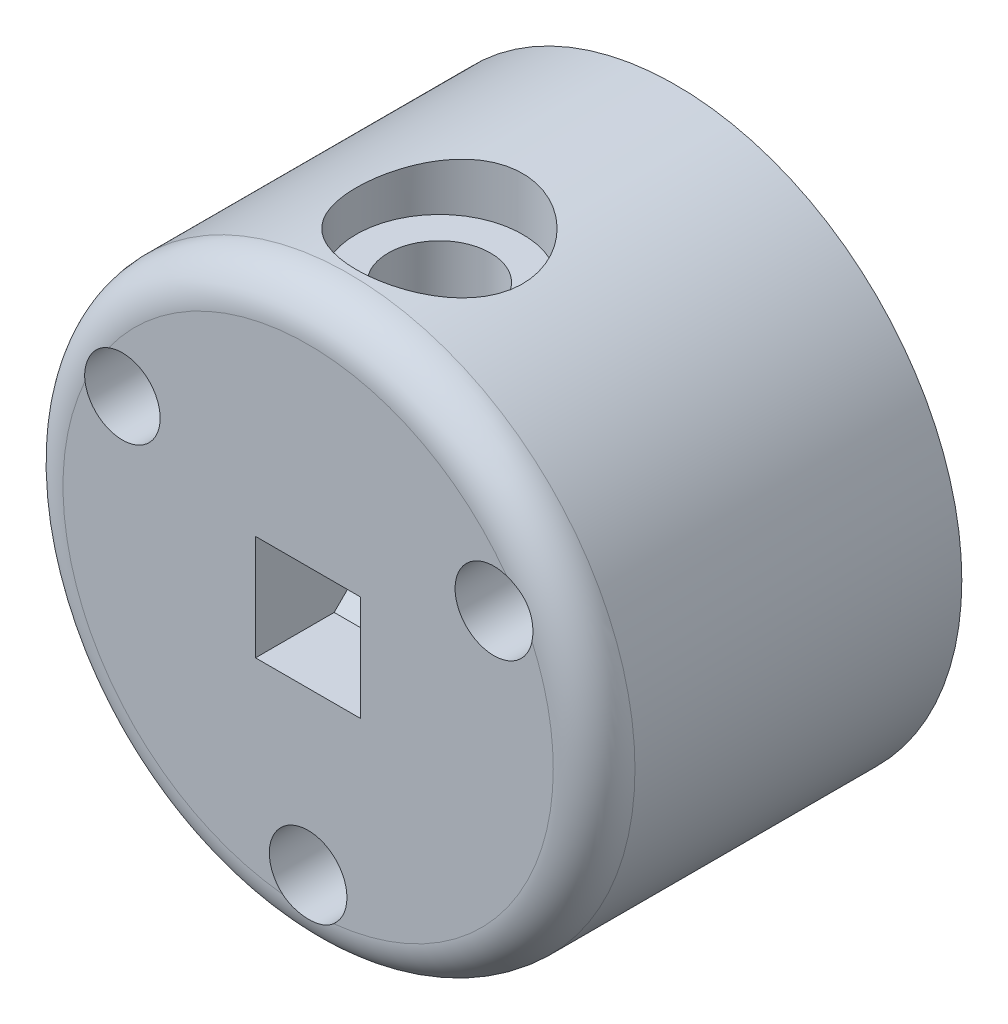
ISO-10303-21;
HEADER;
FILE_DESCRIPTION(('STEP AP214'),'2;1');
FILE_NAME('part.step','',(''),(''),'','','');
FILE_SCHEMA(('AUTOMOTIVE_DESIGN { 1 0 10303 214 1 1 1 1 }'));
ENDSEC;
DATA;
#1=APPLICATION_CONTEXT('core data for automotive mechanical design processes');
#2=APPLICATION_PROTOCOL_DEFINITION('international standard','automotive_design',2000,#1);
#3=PRODUCT_CONTEXT('',#1,'mechanical');
#4=PRODUCT('Part','Part','',(#3));
#5=PRODUCT_RELATED_PRODUCT_CATEGORY('part','',(#4));
#6=PRODUCT_DEFINITION_FORMATION('','',#4);
#7=PRODUCT_DEFINITION_CONTEXT('part definition',#1,'design');
#8=PRODUCT_DEFINITION('design','',#6,#7);
#9=PRODUCT_DEFINITION_SHAPE('','',#8);
#10=(LENGTH_UNIT() NAMED_UNIT(*) SI_UNIT(.MILLI.,.METRE.));
#11=(NAMED_UNIT(*) PLANE_ANGLE_UNIT() SI_UNIT($,.RADIAN.));
#12=(NAMED_UNIT(*) SI_UNIT($,.STERADIAN.) SOLID_ANGLE_UNIT());
#13=UNCERTAINTY_MEASURE_WITH_UNIT(LENGTH_MEASURE(1.E-05),#10,'distance_accuracy_value','');
#14=(GEOMETRIC_REPRESENTATION_CONTEXT(3) GLOBAL_UNCERTAINTY_ASSIGNED_CONTEXT((#13)) GLOBAL_UNIT_ASSIGNED_CONTEXT((#10,
#11,#12)) REPRESENTATION_CONTEXT('',''));
#15=CARTESIAN_POINT('',(0.,0.,0.));
#16=DIRECTION('',(0.,0.,1.));
#17=DIRECTION('',(1.,0.,0.));
#18=AXIS2_PLACEMENT_3D('',#15,#16,#17);
#19=CARTESIAN_POINT('',(0.,20.575,11.575));
#20=DIRECTION('',(0.,-1.,0.));
#21=DIRECTION('',(0.,0.,-1.));
#22=AXIS2_PLACEMENT_3D('',#19,#20,#21);
#23=CYLINDRICAL_SURFACE('',#22,2.5);
#24=CARTESIAN_POINT('',(0.,2.575,11.575));
#25=DIRECTION('',(0.,-1.,0.));
#26=DIRECTION('',(0.,0.,-1.));
#27=AXIS2_PLACEMENT_3D('',#24,#25,#26);
#28=CIRCLE('',#27,2.5);
#29=CARTESIAN_POINT('',(0.,2.575,9.07500000000001));
#30=VERTEX_POINT('',#29);
#31=EDGE_CURVE('E216',#30,#30,#28,.T.);
#32=ORIENTED_EDGE('',*,*,#31,.T.);
#33=EDGE_LOOP('',(#32));
#34=FACE_BOUND('',#33,.T.);
#35=CARTESIAN_POINT('',(0.,11.4164078649987,11.575));
#36=DIRECTION('',(0.,1.,0.));
#37=DIRECTION('',(0.,0.,1.));
#38=AXIS2_PLACEMENT_3D('',#35,#36,#37);
#39=CIRCLE('',#38,2.5);
#40=CARTESIAN_POINT('',(0.,11.4164078649987,14.075));
#41=VERTEX_POINT('',#40);
#42=EDGE_CURVE('E210',#41,#41,#39,.F.);
#43=ORIENTED_EDGE('',*,*,#42,.F.);
#44=EDGE_LOOP('',(#43));
#45=FACE_BOUND('',#44,.T.);
#46=ADVANCED_FACE('F35',(#34,#45),#23,.F.);
#47=CARTESIAN_POINT('',(0.,0.,22.));
#48=DIRECTION('',(0.,0.,-1.));
#49=DIRECTION('',(-1.,0.,0.));
#50=AXIS2_PLACEMENT_3D('',#47,#48,#49);
#51=CYLINDRICAL_SURFACE('',#50,14.);
#52=CARTESIAN_POINT('',(0.,14.,15.65));
#53=CARTESIAN_POINT('',(-0.223854655469927,13.9999975932515,15.6499964915354));
#54=CARTESIAN_POINT('',(-0.447745073296723,13.9945792185035,15.6314928943772));
#55=CARTESIAN_POINT('',(-0.88902537024807,13.9734926641267,15.5581305299539));
#56=CARTESIAN_POINT('',(-1.1064129553758,13.9578209109947,15.5032590876956));
#57=CARTESIAN_POINT('',(-1.52825779417562,13.9179483166286,15.3591341932266));
#58=CARTESIAN_POINT('',(-1.73273298527214,13.8937596285321,15.2699297153308));
#59=CARTESIAN_POINT('',(-2.123823315558,13.8393789157117,15.0598664867856));
#60=CARTESIAN_POINT('',(-2.31043639201679,13.809186198874,14.9390040862626));
#61=CARTESIAN_POINT('',(-2.66557900733791,13.7451109529002,14.6655911784061));
#62=CARTESIAN_POINT('',(-2.8335541023685,13.7111561966808,14.512337444461));
#63=CARTESIAN_POINT('',(-3.14181891391625,13.6438235572355,14.1799921487467));
#64=CARTESIAN_POINT('',(-3.2821042959688,13.6104457650709,14.0008965493529));
#65=CARTESIAN_POINT('',(-3.53386472447389,13.5472893352413,13.6173344437628));
#66=CARTESIAN_POINT('',(-3.64467392770465,13.5176008496088,13.4124146646601));
#67=CARTESIAN_POINT('',(-3.83003668374098,13.4662591658294,12.9858466070145));
#68=CARTESIAN_POINT('',(-3.90459836890721,13.4446041655777,12.764202093675));
#69=CARTESIAN_POINT('',(-4.01337071562984,13.4125320588944,12.3166795849564));
#70=CARTESIAN_POINT('',(-4.04859898265162,13.4018321713561,12.0910697184409));
#71=CARTESIAN_POINT('',(-4.08088082327906,13.3920394800779,11.6369078728874));
#72=CARTESIAN_POINT('',(-4.07794304091861,13.3929440481035,11.4083565717543));
#73=CARTESIAN_POINT('',(-4.03477783019962,13.4060067450529,10.9629795759345));
#74=CARTESIAN_POINT('',(-3.99581279639697,13.4177838781798,10.7460185279017));
#75=CARTESIAN_POINT('',(-3.88373382483836,13.4506501131767,10.3218563446633));
#76=CARTESIAN_POINT('',(-3.81061669533787,13.4717400853846,10.1146561236658));
#77=CARTESIAN_POINT('',(-3.63135218679836,13.5211682308823,9.71275338401689));
#78=CARTESIAN_POINT('',(-3.52478626326112,13.549597391142,9.51824921934972));
#79=CARTESIAN_POINT('',(-3.28194032683873,13.6104555012872,9.1494552595611));
#80=CARTESIAN_POINT('',(-3.14565348005207,13.6428853703324,8.97517012766028));
#81=CARTESIAN_POINT('',(-2.84091306778801,13.7096474706407,8.64458623416677));
#82=CARTESIAN_POINT('',(-2.67140827378113,13.7440044498963,8.48925993486754));
#83=CARTESIAN_POINT('',(-2.30832990209667,13.809619770865,8.20901876769532));
#84=CARTESIAN_POINT('',(-2.11475498225879,13.8408779396124,8.08410559682092));
#85=CARTESIAN_POINT('',(-1.7073370687848,13.8970313755333,7.86769226459663));
#86=CARTESIAN_POINT('',(-1.49337962628358,13.9218874116628,7.77639670688054));
#87=CARTESIAN_POINT('',(-1.05225828766325,13.9621533224821,7.63136668935529));
#88=CARTESIAN_POINT('',(-0.825097867978545,13.9775656715334,7.57762239013919));
#89=CARTESIAN_POINT('',(-0.372294767959097,13.9968210314728,7.51081369486199));
#90=CARTESIAN_POINT('',(-0.146862361528772,14.0010390385308,7.49643022717675));
#91=CARTESIAN_POINT('',(0.303204317578375,13.9985244794481,7.50506946932812));
#92=CARTESIAN_POINT('',(0.527838686464654,13.9917932815482,7.528087505376));
#93=CARTESIAN_POINT('',(0.965029510881966,13.9683813245689,7.60980503052112));
#94=CARTESIAN_POINT('',(1.17774065064616,13.9519129091333,7.66774350228958));
#95=CARTESIAN_POINT('',(1.59038479495726,13.9109204272878,7.81675054432684));
#96=CARTESIAN_POINT('',(1.79031629546684,13.8863954147735,7.90782300572963));
#97=CARTESIAN_POINT('',(2.17665551673273,13.8311649861528,8.12279089347821));
#98=CARTESIAN_POINT('',(2.36266419738823,13.800334388829,8.24737046253601));
#99=CARTESIAN_POINT('',(2.71158950480605,13.7360406339625,8.52497719695255));
#100=CARTESIAN_POINT('',(2.8745006630614,13.7025768559016,8.67801107932035));
#101=CARTESIAN_POINT('',(3.17834731991831,13.6353649308793,9.01437149873764));
#102=CARTESIAN_POINT('',(3.31834602450779,13.601645877628,9.19855185838806));
#103=CARTESIAN_POINT('',(3.56550234215855,13.5389626578495,9.58852118079462));
#104=CARTESIAN_POINT('',(3.67266100456062,13.5099983394077,9.79430945282903));
#105=CARTESIAN_POINT('',(3.85032911026586,13.460441393492,10.2208665750983));
#106=CARTESIAN_POINT('',(3.92102505439581,13.4398062838623,10.441552528873));
#107=CARTESIAN_POINT('',(4.02406638172604,13.409318879457,10.8924017407376));
#108=CARTESIAN_POINT('',(4.05642393983087,13.3994631616074,11.1225619660987));
#109=CARTESIAN_POINT('',(4.08107610783079,13.3919737998199,11.576135347318));
#110=CARTESIAN_POINT('',(4.07489148192856,13.3938761896151,11.7994593093071));
#111=CARTESIAN_POINT('',(4.02623643259421,13.4085812819218,12.2417345600363));
#112=CARTESIAN_POINT('',(3.98376730710923,13.4213835945278,12.4606860049008));
#113=CARTESIAN_POINT('',(3.86470410379516,13.4561441582198,12.8856750763565));
#114=CARTESIAN_POINT('',(3.78849028647301,13.4780002129358,13.0918282034438));
#115=CARTESIAN_POINT('',(3.60439575153752,13.5283922905509,13.4885851880944));
#116=CARTESIAN_POINT('',(3.49650925582451,13.5569295321176,13.6791862003442));
#117=CARTESIAN_POINT('',(3.24776706346828,13.6186983847277,14.0465425395881));
#118=CARTESIAN_POINT('',(3.10590183133288,13.6520580395081,14.2225927880914));
#119=CARTESIAN_POINT('',(2.79507475204947,13.7190668065959,14.5488816954975));
#120=CARTESIAN_POINT('',(2.62610601395703,13.7527159904505,14.6991137700715));
#121=CARTESIAN_POINT('',(2.26037876871163,13.8175993540115,14.9735239509894));
#122=CARTESIAN_POINT('',(2.06299391180743,13.8487439786545,15.0968905368656));
#123=CARTESIAN_POINT('',(1.64937808494276,13.9040629840343,15.3085070548442));
#124=CARTESIAN_POINT('',(1.43315694248033,13.9282409714614,15.3967751667667));
#125=CARTESIAN_POINT('',(1.0154197309062,13.9645037904108,15.5267557281237));
#126=CARTESIAN_POINT('',(0.815355607669857,13.9777086039219,15.5728522953755));
#127=CARTESIAN_POINT('',(0.410203841367488,13.9954571812365,15.6344738144954));
#128=CARTESIAN_POINT('',(0.20511693366376,14.0000022052919,15.6500032147891));
#129=CARTESIAN_POINT('',(0.,14.,15.65));
#130=B_SPLINE_CURVE_WITH_KNOTS('',3,(#52,#53,#54,#55,#56,#57,#58,#59,#60,#61,#62,#63,#64,#65,
#66,#67,#68,#69,#70,#71,#72,#73,#74,#75,#76,#77,#78,#79,#80,#81,#82,#83,#84,#85,#86,#87,#88,#89,
#90,#91,#92,#93,#94,#95,#96,#97,#98,#99,#100,#101,#102,#103,#104,#105,#106,#107,#108,#109,#110,
#111,#112,#113,#114,#115,#116,#117,#118,#119,#120,#121,#122,#123,#124,#125,#126,#127,#128,#129),
.UNSPECIFIED.,.T.,.F.,(4,2,2,2,2,2,2,2,2,2,2,2,2,2,2,2,2,2,2,2,2,2,2,2,2,2,2,2,2,2,2,2,2,2,2,2,
2,2,4),(0.,0.670810870883039,1.34185565712039,2.01194675892948,2.68211515024255,
3.36868746986491,4.05536717837259,4.75644658538705,5.45736862811399,6.13970344446604,
6.82188372497978,7.48103090955527,8.14023970822678,8.80805016017638,9.4760143278037,
10.1701538911145,10.8643321773094,11.5626681501811,12.2608210721635,12.9352729330826,
13.6096405192325,14.2698177572771,14.9300725491492,15.6049931889712,16.2800733552935,
16.978132717206,17.6761697716393,18.3706001624563,19.0648099677823,19.7318064055585,
20.3987789849414,21.0584196740221,21.7181807773171,22.4007168210781,23.0834266724126,
23.7845405935671,24.4852908869394,25.1000411010829,25.7147018443004),.UNSPECIFIED.);
#131=CARTESIAN_POINT('',(0.,14.,15.65));
#132=VERTEX_POINT('',#131);
#133=EDGE_CURVE('E40',#132,#132,#130,.T.);
#134=ORIENTED_EDGE('',*,*,#133,.T.);
#135=EDGE_LOOP('',(#134));
#136=FACE_BOUND('',#135,.T.);
#137=CARTESIAN_POINT('',(0.,0.,16.));
#138=DIRECTION('',(0.,0.,1.));
#139=DIRECTION('',(1.,0.,0.));
#140=AXIS2_PLACEMENT_3D('',#137,#138,#139);
#141=CIRCLE('',#140,14.);
#142=CARTESIAN_POINT('',(14.,0.,16.));
#143=VERTEX_POINT('',#142);
#144=EDGE_CURVE('E11',#143,#143,#141,.F.);
#145=ORIENTED_EDGE('',*,*,#144,.T.);
#146=EDGE_LOOP('',(#145));
#147=FACE_BOUND('',#146,.T.);
#148=CARTESIAN_POINT('',(0.,0.,0.));
#149=DIRECTION('',(0.,0.,1.));
#150=DIRECTION('',(1.,0.,0.));
#151=AXIS2_PLACEMENT_3D('',#148,#149,#150);
#152=CIRCLE('',#151,14.);
#153=CARTESIAN_POINT('',(14.,0.,0.));
#154=VERTEX_POINT('',#153);
#155=EDGE_CURVE('E111',#154,#154,#152,.T.);
#156=ORIENTED_EDGE('',*,*,#155,.T.);
#157=EDGE_LOOP('',(#156));
#158=FACE_BOUND('',#157,.T.);
#159=ADVANCED_FACE('F192',(#136,#147,#158),#51,.T.);
#160=CARTESIAN_POINT('',(-9.0932667397366,5.25,3.));
#161=DIRECTION('',(0.,0.,1.));
#162=DIRECTION('',(1.,0.,0.));
#163=AXIS2_PLACEMENT_3D('',#160,#161,#162);
#164=CYLINDRICAL_SURFACE('',#163,1.85);
#165=CARTESIAN_POINT('',(-9.0932667397366,5.25,3.));
#166=DIRECTION('',(0.,0.,1.));
#167=DIRECTION('',(1.,0.,0.));
#168=AXIS2_PLACEMENT_3D('',#165,#166,#167);
#169=CIRCLE('',#168,1.85);
#170=CARTESIAN_POINT('',(-7.2432667397366,5.25,3.));
#171=VERTEX_POINT('',#170);
#172=EDGE_CURVE('E139',#171,#171,#169,.T.);
#173=ORIENTED_EDGE('',*,*,#172,.F.);
#174=EDGE_LOOP('',(#173));
#175=FACE_BOUND('',#174,.T.);
#176=CARTESIAN_POINT('',(-9.0932667397366,5.25,18.));
#177=DIRECTION('',(0.,0.,1.));
#178=DIRECTION('',(1.,0.,0.));
#179=AXIS2_PLACEMENT_3D('',#176,#177,#178);
#180=CIRCLE('',#179,1.85);
#181=CARTESIAN_POINT('',(-9.76583355470285,6.97341343832702,18.));
#182=VERTEX_POINT('',#181);
#183=CARTESIAN_POINT('',(-10.9220699660344,4.97075322833965,18.));
#184=VERTEX_POINT('',#183);
#185=EDGE_CURVE('E230',#182,#184,#180,.F.);
#186=ORIENTED_EDGE('',*,*,#185,.F.);
#187=CARTESIAN_POINT('',(-9.76583355470285,6.97341343832702,18.));
#188=CARTESIAN_POINT('',(-9.81419478291767,6.95454034418415,17.9999953490431));
#189=CARTESIAN_POINT('',(-9.86173150149319,6.93364206673434,17.9993962519027));
#190=CARTESIAN_POINT('',(-9.95486035288913,6.88794034133642,17.9973793504741));
#191=CARTESIAN_POINT('',(-10.0004528710693,6.863137671893,17.995961709247));
#192=CARTESIAN_POINT('',(-10.1338250744244,6.78312286784872,17.9910383027019));
#193=CARTESIAN_POINT('',(-10.2182811861827,6.72227191888798,17.9868608095263));
#194=CARTESIAN_POINT('',(-10.375802516048,6.58730134554035,17.9791132411159));
#195=CARTESIAN_POINT('',(-10.4488664669279,6.51318024699217,17.9755432334518));
#196=CARTESIAN_POINT('',(-10.5815472268755,6.3537471598713,17.9705749489343));
#197=CARTESIAN_POINT('',(-10.6411741387818,6.26844365580235,17.9691750357757));
#198=CARTESIAN_POINT('',(-10.7451549022834,6.08932608168787,17.9691003437342));
#199=CARTESIAN_POINT('',(-10.7895510519696,5.99553651060639,17.9704179452693));
#200=CARTESIAN_POINT('',(-10.8620855700994,5.80179158839658,17.9752480139006));
#201=CARTESIAN_POINT('',(-10.8902115162802,5.70183159043051,17.9787621538015));
#202=CARTESIAN_POINT('',(-10.9197792814844,5.54856828612012,17.9845559925943));
#203=CARTESIAN_POINT('',(-10.9275434115511,5.49639607068947,17.9865971467026));
#204=CARTESIAN_POINT('',(-10.9385945757635,5.39156097069196,17.9905524255186));
#205=CARTESIAN_POINT('',(-10.9418816583123,5.33889809143606,17.9924665515996));
#206=CARTESIAN_POINT('',(-10.9439441583613,5.23346352772024,17.9958392741598));
#207=CARTESIAN_POINT('',(-10.9427189279102,5.18069182872168,17.9972978051848));
#208=CARTESIAN_POINT('',(-10.9357677880781,5.07542028435191,17.9993750911791));
#209=CARTESIAN_POINT('',(-10.9300410336698,5.02292049188584,17.9999936884164));
#210=CARTESIAN_POINT('',(-10.9220699660344,4.97075322833965,18.));
#211=B_SPLINE_CURVE_WITH_KNOTS('',3,(#187,#188,#189,#190,#191,#192,#193,#194,#195,#196,#197,
#198,#199,#200,#201,#202,#203,#204,#205,#206,#207,#208,#209,#210),.UNSPECIFIED.,.F.,.F.,(4,2,2,
2,2,2,2,2,2,2,2,4),(0.,0.155631865288573,0.311232738036358,0.622174380070197,0.933150585608174,
1.24389219310237,1.55376370335756,1.86387148859661,2.02207196120744,2.18027072343681,
2.33849220330872,2.49674339165615),.UNSPECIFIED.);
#212=EDGE_CURVE('E175',#182,#184,#211,.T.);
#213=ORIENTED_EDGE('',*,*,#212,.T.);
#214=EDGE_LOOP('',(#186,#213));
#215=FACE_BOUND('',#214,.T.);
#216=ADVANCED_FACE('F186',(#175,#215),#164,.F.);
#217=CARTESIAN_POINT('',(9.0932667397366,5.25000000000001,3.));
#218=DIRECTION('',(0.,0.,1.));
#219=DIRECTION('',(1.,0.,0.));
#220=AXIS2_PLACEMENT_3D('',#217,#218,#219);
#221=CYLINDRICAL_SURFACE('',#220,1.9);
#222=CARTESIAN_POINT('',(9.0932667397366,5.25000000000001,3.));
#223=DIRECTION('',(0.,0.,1.));
#224=DIRECTION('',(1.,0.,0.));
#225=AXIS2_PLACEMENT_3D('',#222,#223,#224);
#226=CIRCLE('',#225,1.9);
#227=CARTESIAN_POINT('',(10.9932667397366,5.25000000000001,3.));
#228=VERTEX_POINT('',#227);
#229=EDGE_CURVE('E142',#228,#228,#226,.T.);
#230=ORIENTED_EDGE('',*,*,#229,.F.);
#231=EDGE_LOOP('',(#230));
#232=FACE_BOUND('',#231,.T.);
#233=CARTESIAN_POINT('',(9.0932667397366,5.25000000000001,18.));
#234=DIRECTION('',(0.,0.,1.));
#235=DIRECTION('',(1.,0.,0.));
#236=AXIS2_PLACEMENT_3D('',#233,#234,#235);
#237=CIRCLE('',#236,1.9);
#238=CARTESIAN_POINT('',(10.9587327660457,4.88939425311515,18.));
#239=VERTEX_POINT('',#238);
#240=CARTESIAN_POINT('',(9.71370601533822,7.04584384212296,18.));
#241=VERTEX_POINT('',#240);
#242=EDGE_CURVE('E227',#239,#241,#237,.F.);
#243=ORIENTED_EDGE('',*,*,#242,.F.);
#244=CARTESIAN_POINT('',(10.9587327660457,4.88939425311515,18.));
#245=CARTESIAN_POINT('',(10.9688443679225,4.9417018114777,17.9999954085785));
#246=CARTESIAN_POINT('',(10.9767478068304,4.99440138836569,17.9993008844636));
#247=CARTESIAN_POINT('',(10.9881037589419,5.10024390536341,17.9969359407984));
#248=CARTESIAN_POINT('',(10.9915574033111,5.15338672933835,17.9952657694208));
#249=CARTESIAN_POINT('',(10.995195111867,5.31289127525907,17.9894010995555));
#250=CARTESIAN_POINT('',(10.988678572368,5.41944685267198,17.984350638412));
#251=CARTESIAN_POINT('',(10.9579318219523,5.62993606889986,17.9746594335247));
#252=CARTESIAN_POINT('',(10.9337015613189,5.73386970035503,17.9700186909308));
#253=CARTESIAN_POINT('',(10.8681887836905,5.93625625505262,17.9630246018036));
#254=CARTESIAN_POINT('',(10.8269166566248,6.03471247628275,17.9606698644858));
#255=CARTESIAN_POINT('',(10.7285578866345,6.22319427031509,17.9591103385104));
#256=CARTESIAN_POINT('',(10.6714979013619,6.31323371490262,17.9599002699465));
#257=CARTESIAN_POINT('',(10.5431374702334,6.4825447878215,17.9643350480736));
#258=CARTESIAN_POINT('',(10.4718257907694,6.56180783853801,17.967982153538));
#259=CARTESIAN_POINT('',(10.3173956125077,6.70694922407907,17.9767297062392));
#260=CARTESIAN_POINT('',(10.2343304779817,6.77288495147714,17.9818236841418));
#261=CARTESIAN_POINT('',(10.0584606552291,6.88997432964337,17.9912118297136));
#262=CARTESIAN_POINT('',(9.96567595247153,6.94115753173,17.9955075900971));
#263=CARTESIAN_POINT('',(9.84388909142107,6.99566635812074,17.9985880502661));
#264=CARTESIAN_POINT('',(9.81814887000062,7.00651025991796,17.9991025086461));
#265=CARTESIAN_POINT('',(9.76624415098066,7.02704159476066,17.9998083011462));
#266=CARTESIAN_POINT('',(9.74008022273438,7.03673045364885,18.00000003757));
#267=CARTESIAN_POINT('',(9.71370601533822,7.04584384212296,18.));
#268=B_SPLINE_CURVE_WITH_KNOTS('',3,(#244,#245,#246,#247,#248,#249,#250,#251,#252,#253,#254,
#255,#256,#257,#258,#259,#260,#261,#262,#263,#264,#265,#266,#267),.UNSPECIFIED.,.F.,.F.,(4,2,2,
2,2,2,2,2,2,2,2,4),(0.,0.159713609557011,0.319386610901691,0.638377428682884,0.957369141771231,
1.27616666138858,1.59442914514376,1.9129434893468,2.23005550790127,2.54652782160906,
2.63031677426456,2.71400119843349),.UNSPECIFIED.);
#269=EDGE_CURVE('E48',#239,#241,#268,.T.);
#270=ORIENTED_EDGE('',*,*,#269,.T.);
#271=EDGE_LOOP('',(#243,#270));
#272=FACE_BOUND('',#271,.T.);
#273=ADVANCED_FACE('F191',(#232,#272),#221,.F.);
#274=CARTESIAN_POINT('',(0.,-10.5,3.));
#275=DIRECTION('',(0.,0.,1.));
#276=DIRECTION('',(1.,0.,0.));
#277=AXIS2_PLACEMENT_3D('',#274,#275,#276);
#278=CYLINDRICAL_SURFACE('',#277,1.9);
#279=CARTESIAN_POINT('',(0.,-10.5,3.));
#280=DIRECTION('',(0.,0.,1.));
#281=DIRECTION('',(1.,0.,0.));
#282=AXIS2_PLACEMENT_3D('',#279,#280,#281);
#283=CIRCLE('',#282,1.9);
#284=CARTESIAN_POINT('',(1.9,-10.5,3.));
#285=VERTEX_POINT('',#284);
#286=EDGE_CURVE('E135',#285,#285,#283,.T.);
#287=ORIENTED_EDGE('',*,*,#286,.F.);
#288=EDGE_LOOP('',(#287));
#289=FACE_BOUND('',#288,.T.);
#290=CARTESIAN_POINT('',(0.,-10.5,18.));
#291=DIRECTION('',(0.,0.,1.));
#292=DIRECTION('',(1.,0.,0.));
#293=AXIS2_PLACEMENT_3D('',#290,#291,#292);
#294=CIRCLE('',#293,1.9);
#295=CARTESIAN_POINT('',(-1.24502675070752,-11.9352380952381,18.));
#296=VERTEX_POINT('',#295);
#297=CARTESIAN_POINT('',(1.24502675070752,-11.9352380952381,18.));
#298=VERTEX_POINT('',#297);
#299=EDGE_CURVE('E120',#296,#298,#294,.F.);
#300=ORIENTED_EDGE('',*,*,#299,.F.);
#301=CARTESIAN_POINT('',(-1.24502675070752,-11.9352380952381,18.));
#302=CARTESIAN_POINT('',(-1.20478287729397,-11.9701487785176,17.9999954085785));
#303=CARTESIAN_POINT('',(-1.16309542439424,-12.0033431458331,17.9993008844636));
#304=CARTESIAN_POINT('',(-1.07711109192949,-12.0660989473447,17.9969359407984));
#305=CARTESIAN_POINT('',(-1.03281487852293,-12.0956613030915,17.9952657694208));
#306=CARTESIAN_POINT('',(-0.896498744014434,-12.1785639240728,17.9894010995555));
#307=CARTESIAN_POINT('',(-0.80096063731047,-12.2261982240284,17.984350638412));
#308=CARTESIAN_POINT('',(-0.603298253626596,-12.3048153651985,17.9746594335247));
#309=CARTESIAN_POINT('',(-0.501173958162126,-12.3357981596772,17.9700186909308));
#310=CARTESIAN_POINT('',(-0.293145671595394,-12.3802557073274,17.9630246018036));
#311=CARTESIAN_POINT('',(-0.187244019316645,-12.3937411074353,17.9606698644858));
#312=CARTESIAN_POINT('',(0.0251653874613588,-12.4028008109549,17.9591103385104));
#313=CARTESIAN_POINT('',(0.131671826453115,-12.398405136463,17.9599002699465));
#314=CARTESIAN_POINT('',(0.342479732307121,-12.3718972787245,17.9643350480736));
#315=CARTESIAN_POINT('',(0.446779387541044,-12.3497710780804,17.967982153538));
#316=CARTESIAN_POINT('',(0.649690603690957,-12.2886013133653,17.9767297062392));
#317=CARTESIAN_POINT('',(0.748325185897672,-12.2496326603961,17.9818236841418));
#318=CARTESIAN_POINT('',(0.937662473279261,-12.1558696152164,17.9912118297136));
#319=CARTESIAN_POINT('',(1.02838077791209,-12.101107306589,17.9955075900971));
#320=CARTESIAN_POINT('',(1.13648023682218,-12.0228912042675,17.9985880502661));
#321=CARTESIAN_POINT('',(1.15874144196494,-12.006021469517,17.9991025086461));
#322=CARTESIAN_POINT('',(1.20247445902231,-11.9713363316908,17.9998083011462));
#323=CARTESIAN_POINT('',(1.22394722107631,-11.9535221346108,18.00000003757));
#324=CARTESIAN_POINT('',(1.24502675070752,-11.9352380952381,18.));
#325=B_SPLINE_CURVE_WITH_KNOTS('',3,(#301,#302,#303,#304,#305,#306,#307,#308,#309,#310,#311,
#312,#313,#314,#315,#316,#317,#318,#319,#320,#321,#322,#323,#324),.UNSPECIFIED.,.F.,.F.,(4,2,2,
2,2,2,2,2,2,2,2,4),(0.,0.15971360955701,0.319386610901691,0.638377428682883,0.95736914177123,
1.27616666138858,1.59442914514376,1.9129434893468,2.23005550790127,2.54652782160906,
2.63031677426456,2.71400119843349),.UNSPECIFIED.);
#326=EDGE_CURVE('E62',#296,#298,#325,.T.);
#327=ORIENTED_EDGE('',*,*,#326,.T.);
#328=EDGE_LOOP('',(#300,#327));
#329=FACE_BOUND('',#328,.T.);
#330=ADVANCED_FACE('F203',(#289,#329),#278,.F.);
#331=CARTESIAN_POINT('',(0.,-10.5,-10.));
#332=DIRECTION('',(0.,0.,1.));
#333=DIRECTION('',(1.,0.,0.));
#334=AXIS2_PLACEMENT_3D('',#331,#332,#333);
#335=CYLINDRICAL_SURFACE('',#334,1.1);
#336=CARTESIAN_POINT('',(0.,-10.5,0.));
#337=DIRECTION('',(0.,0.,1.));
#338=DIRECTION('',(1.,0.,0.));
#339=AXIS2_PLACEMENT_3D('',#336,#337,#338);
#340=CIRCLE('',#339,1.1);
#341=CARTESIAN_POINT('',(1.1,-10.5,0.));
#342=VERTEX_POINT('',#341);
#343=EDGE_CURVE('E154',#342,#342,#340,.T.);
#344=ORIENTED_EDGE('',*,*,#343,.F.);
#345=EDGE_LOOP('',(#344));
#346=FACE_BOUND('',#345,.T.);
#347=CARTESIAN_POINT('',(0.,-10.5,3.));
#348=DIRECTION('',(0.,0.,1.));
#349=DIRECTION('',(1.,0.,0.));
#350=AXIS2_PLACEMENT_3D('',#347,#348,#349);
#351=CIRCLE('',#350,1.1);
#352=CARTESIAN_POINT('',(1.1,-10.5,3.));
#353=VERTEX_POINT('',#352);
#354=EDGE_CURVE('E158',#353,#353,#351,.F.);
#355=ORIENTED_EDGE('',*,*,#354,.F.);
#356=EDGE_LOOP('',(#355));
#357=FACE_BOUND('',#356,.T.);
#358=ADVANCED_FACE('F335',(#346,#357),#335,.F.);
#359=CARTESIAN_POINT('',(9.0932667397366,5.25000000000001,-10.));
#360=DIRECTION('',(0.,0.,1.));
#361=DIRECTION('',(1.,0.,0.));
#362=AXIS2_PLACEMENT_3D('',#359,#360,#361);
#363=CYLINDRICAL_SURFACE('',#362,1.1);
#364=CARTESIAN_POINT('',(9.0932667397366,5.25000000000001,0.));
#365=DIRECTION('',(0.,0.,1.));
#366=DIRECTION('',(1.,0.,0.));
#367=AXIS2_PLACEMENT_3D('',#364,#365,#366);
#368=CIRCLE('',#367,1.1);
#369=CARTESIAN_POINT('',(10.1932667397366,5.25000000000001,0.));
#370=VERTEX_POINT('',#369);
#371=EDGE_CURVE('E157',#370,#370,#368,.T.);
#372=ORIENTED_EDGE('',*,*,#371,.F.);
#373=EDGE_LOOP('',(#372));
#374=FACE_BOUND('',#373,.T.);
#375=CARTESIAN_POINT('',(9.0932667397366,5.25000000000001,3.));
#376=DIRECTION('',(0.,0.,1.));
#377=DIRECTION('',(1.,0.,0.));
#378=AXIS2_PLACEMENT_3D('',#375,#376,#377);
#379=CIRCLE('',#378,1.1);
#380=CARTESIAN_POINT('',(10.1932667397366,5.25000000000001,3.));
#381=VERTEX_POINT('',#380);
#382=EDGE_CURVE('E165',#381,#381,#379,.F.);
#383=ORIENTED_EDGE('',*,*,#382,.F.);
#384=EDGE_LOOP('',(#383));
#385=FACE_BOUND('',#384,.T.);
#386=ADVANCED_FACE('F341',(#374,#385),#363,.F.);
#387=CARTESIAN_POINT('',(-9.0932667397366,5.25,-10.));
#388=DIRECTION('',(0.,0.,1.));
#389=DIRECTION('',(1.,0.,0.));
#390=AXIS2_PLACEMENT_3D('',#387,#388,#389);
#391=CYLINDRICAL_SURFACE('',#390,1.1);
#392=CARTESIAN_POINT('',(-9.0932667397366,5.25,0.));
#393=DIRECTION('',(0.,0.,1.));
#394=DIRECTION('',(1.,0.,0.));
#395=AXIS2_PLACEMENT_3D('',#392,#393,#394);
#396=CIRCLE('',#395,1.1);
#397=CARTESIAN_POINT('',(-7.9932667397366,5.25,0.));
#398=VERTEX_POINT('',#397);
#399=EDGE_CURVE('E151',#398,#398,#396,.T.);
#400=ORIENTED_EDGE('',*,*,#399,.F.);
#401=EDGE_LOOP('',(#400));
#402=FACE_BOUND('',#401,.T.);
#403=CARTESIAN_POINT('',(-9.0932667397366,5.25,3.));
#404=DIRECTION('',(0.,0.,1.));
#405=DIRECTION('',(1.,0.,0.));
#406=AXIS2_PLACEMENT_3D('',#403,#404,#405);
#407=CIRCLE('',#406,1.1);
#408=CARTESIAN_POINT('',(-7.9932667397366,5.25,3.));
#409=VERTEX_POINT('',#408);
#410=EDGE_CURVE('E138',#409,#409,#407,.F.);
#411=ORIENTED_EDGE('',*,*,#410,.F.);
#412=EDGE_LOOP('',(#411));
#413=FACE_BOUND('',#412,.T.);
#414=ADVANCED_FACE('F205',(#402,#413),#391,.F.);
#415=CARTESIAN_POINT('',(0.,0.,0.));
#416=DIRECTION('',(0.,0.,1.));
#417=DIRECTION('',(1.,0.,0.));
#418=AXIS2_PLACEMENT_3D('',#415,#416,#417);
#419=PLANE('',#418);
#420=ORIENTED_EDGE('',*,*,#399,.T.);
#421=EDGE_LOOP('',(#420));
#422=FACE_BOUND('',#421,.T.);
#423=ORIENTED_EDGE('',*,*,#371,.T.);
#424=EDGE_LOOP('',(#423));
#425=FACE_BOUND('',#424,.T.);
#426=ORIENTED_EDGE('',*,*,#343,.T.);
#427=EDGE_LOOP('',(#426));
#428=FACE_BOUND('',#427,.T.);
#429=CARTESIAN_POINT('',(0.,0.,0.));
#430=DIRECTION('',(0.,0.,-1.));
#431=DIRECTION('',(-1.,0.,0.));
#432=AXIS2_PLACEMENT_3D('',#429,#430,#431);
#433=CIRCLE('',#432,7.35);
#434=CARTESIAN_POINT('',(-7.35,0.,0.));
#435=VERTEX_POINT('',#434);
#436=EDGE_CURVE('E148',#435,#435,#433,.T.);
#437=ORIENTED_EDGE('',*,*,#436,.F.);
#438=EDGE_LOOP('',(#437));
#439=FACE_BOUND('',#438,.T.);
#440=ORIENTED_EDGE('',*,*,#155,.F.);
#441=EDGE_LOOP('',(#440));
#442=FACE_BOUND('',#441,.T.);
#443=ADVANCED_FACE('F356',(#422,#425,#428,#439,#442),#419,.F.);
#444=CARTESIAN_POINT('',(0.,0.,6.));
#445=DIRECTION('',(0.,0.,-1.));
#446=DIRECTION('',(-1.,0.,0.));
#447=AXIS2_PLACEMENT_3D('',#444,#445,#446);
#448=CYLINDRICAL_SURFACE('',#447,7.35);
#449=CARTESIAN_POINT('',(0.,0.,6.));
#450=DIRECTION('',(0.,0.,-1.));
#451=DIRECTION('',(-1.,0.,0.));
#452=AXIS2_PLACEMENT_3D('',#449,#450,#451);
#453=CIRCLE('',#452,7.35);
#454=CARTESIAN_POINT('',(-7.35,0.,6.));
#455=VERTEX_POINT('',#454);
#456=EDGE_CURVE('E145',#455,#455,#453,.T.);
#457=ORIENTED_EDGE('',*,*,#456,.F.);
#458=EDGE_LOOP('',(#457));
#459=FACE_BOUND('',#458,.T.);
#460=ORIENTED_EDGE('',*,*,#436,.T.);
#461=EDGE_LOOP('',(#460));
#462=FACE_BOUND('',#461,.T.);
#463=ADVANCED_FACE('F363',(#459,#462),#448,.F.);
#464=CARTESIAN_POINT('',(0.,0.,6.));
#465=DIRECTION('',(0.,0.,-1.));
#466=DIRECTION('',(-1.,0.,0.));
#467=AXIS2_PLACEMENT_3D('',#464,#465,#466);
#468=PLANE('',#467);
#469=ORIENTED_EDGE('',*,*,#456,.T.);
#470=EDGE_LOOP('',(#469));
#471=FACE_BOUND('',#470,.T.);
#472=ADVANCED_FACE('F372',(#471),#468,.T.);
#473=CARTESIAN_POINT('',(-9.0932667397366,5.25,3.));
#474=DIRECTION('',(0.,0.,1.));
#475=DIRECTION('',(1.,0.,0.));
#476=AXIS2_PLACEMENT_3D('',#473,#474,#475);
#477=PLANE('',#476);
#478=ORIENTED_EDGE('',*,*,#172,.T.);
#479=EDGE_LOOP('',(#478));
#480=FACE_BOUND('',#479,.T.);
#481=ORIENTED_EDGE('',*,*,#410,.T.);
#482=EDGE_LOOP('',(#481));
#483=FACE_BOUND('',#482,.T.);
#484=ADVANCED_FACE('F194',(#480,#483),#477,.T.);
#485=CARTESIAN_POINT('',(9.0932667397366,5.25000000000001,3.));
#486=DIRECTION('',(0.,0.,1.));
#487=DIRECTION('',(1.,0.,0.));
#488=AXIS2_PLACEMENT_3D('',#485,#486,#487);
#489=PLANE('',#488);
#490=ORIENTED_EDGE('',*,*,#229,.T.);
#491=EDGE_LOOP('',(#490));
#492=FACE_BOUND('',#491,.T.);
#493=ORIENTED_EDGE('',*,*,#382,.T.);
#494=EDGE_LOOP('',(#493));
#495=FACE_BOUND('',#494,.T.);
#496=ADVANCED_FACE('F195',(#492,#495),#489,.T.);
#497=CARTESIAN_POINT('',(0.,-10.5,3.));
#498=DIRECTION('',(0.,0.,1.));
#499=DIRECTION('',(1.,0.,0.));
#500=AXIS2_PLACEMENT_3D('',#497,#498,#499);
#501=PLANE('',#500);
#502=ORIENTED_EDGE('',*,*,#286,.T.);
#503=EDGE_LOOP('',(#502));
#504=FACE_BOUND('',#503,.T.);
#505=ORIENTED_EDGE('',*,*,#354,.T.);
#506=EDGE_LOOP('',(#505));
#507=FACE_BOUND('',#506,.T.);
#508=ADVANCED_FACE('F198',(#504,#507),#501,.T.);
#509=CARTESIAN_POINT('',(0.,0.,18.));
#510=DIRECTION('',(0.,0.,1.));
#511=DIRECTION('',(1.,0.,0.));
#512=AXIS2_PLACEMENT_3D('',#509,#510,#511);
#513=PLANE('',#512);
#514=ORIENTED_EDGE('',*,*,#242,.T.);
#515=CARTESIAN_POINT('',(0.,0.,18.));
#516=DIRECTION('',(0.,0.,1.));
#517=DIRECTION('',(1.,0.,0.));
#518=AXIS2_PLACEMENT_3D('',#515,#516,#517);
#519=CIRCLE('',#518,12.);
#520=EDGE_CURVE('E172',#241,#182,#519,.T.);
#521=ORIENTED_EDGE('',*,*,#520,.T.);
#522=ORIENTED_EDGE('',*,*,#185,.T.);
#523=CARTESIAN_POINT('',(0.,0.,18.));
#524=DIRECTION('',(0.,0.,1.));
#525=DIRECTION('',(1.,0.,0.));
#526=AXIS2_PLACEMENT_3D('',#523,#524,#525);
#527=CIRCLE('',#526,12.);
#528=EDGE_CURVE('E56',#184,#296,#527,.T.);
#529=ORIENTED_EDGE('',*,*,#528,.T.);
#530=ORIENTED_EDGE('',*,*,#299,.T.);
#531=CARTESIAN_POINT('',(0.,0.,18.));
#532=DIRECTION('',(0.,0.,1.));
#533=DIRECTION('',(1.,0.,0.));
#534=AXIS2_PLACEMENT_3D('',#531,#532,#533);
#535=CIRCLE('',#534,12.);
#536=EDGE_CURVE('E110',#298,#239,#535,.T.);
#537=ORIENTED_EDGE('',*,*,#536,.T.);
#538=EDGE_LOOP('',(#514,#521,#522,#529,#530,#537));
#539=FACE_BOUND('',#538,.T.);
#540=DIRECTION('',(0.,-1.,0.));
#541=VECTOR('',#540,1.);
#542=CARTESIAN_POINT('',(2.575,-2.575,18.));
#543=LINE('',#542,#541);
#544=CARTESIAN_POINT('',(2.575,2.575,18.));
#545=VERTEX_POINT('',#544);
#546=CARTESIAN_POINT('',(2.575,-2.575,18.));
#547=VERTEX_POINT('',#546);
#548=EDGE_CURVE('E103',#545,#547,#543,.T.);
#549=ORIENTED_EDGE('',*,*,#548,.T.);
#550=DIRECTION('',(-1.,0.,0.));
#551=VECTOR('',#550,1.);
#552=CARTESIAN_POINT('',(-2.575,-2.575,18.));
#553=LINE('',#552,#551);
#554=CARTESIAN_POINT('',(-2.575,-2.575,18.));
#555=VERTEX_POINT('',#554);
#556=EDGE_CURVE('E121',#547,#555,#553,.T.);
#557=ORIENTED_EDGE('',*,*,#556,.T.);
#558=DIRECTION('',(0.,1.,0.));
#559=VECTOR('',#558,1.);
#560=CARTESIAN_POINT('',(-2.575,-2.575,18.));
#561=LINE('',#560,#559);
#562=CARTESIAN_POINT('',(-2.575,2.575,18.));
#563=VERTEX_POINT('',#562);
#564=EDGE_CURVE('E106',#555,#563,#561,.T.);
#565=ORIENTED_EDGE('',*,*,#564,.T.);
#566=DIRECTION('',(1.,0.,0.));
#567=VECTOR('',#566,1.);
#568=CARTESIAN_POINT('',(-2.575,2.575,18.));
#569=LINE('',#568,#567);
#570=EDGE_CURVE('E100',#563,#545,#569,.T.);
#571=ORIENTED_EDGE('',*,*,#570,.T.);
#572=EDGE_LOOP('',(#549,#557,#565,#571));
#573=FACE_BOUND('',#572,.T.);
#574=ADVANCED_FACE('F102',(#539,#573),#513,.T.);
#575=CARTESIAN_POINT('',(500000.,-2.575,14.15));
#576=DIRECTION('',(0.,-0.707106781186547,-0.707106781186548));
#577=DIRECTION('',(0.,0.707106781186548,-0.707106781186547));
#578=AXIS2_PLACEMENT_3D('',#575,#576,#577);
#579=PLANE('',#578);
#580=DIRECTION('',(0.,-0.707106781186548,0.707106781186547));
#581=VECTOR('',#580,1.);
#582=CARTESIAN_POINT('',(2.5749999999789,-2.575,14.15));
#583=LINE('',#582,#581);
#584=CARTESIAN_POINT('',(2.575,2.575,9.00000000000001));
#585=VERTEX_POINT('',#584);
#586=CARTESIAN_POINT('',(2.575,-2.575,14.15));
#587=VERTEX_POINT('',#586);
#588=EDGE_CURVE('E131',#585,#587,#583,.T.);
#589=ORIENTED_EDGE('',*,*,#588,.F.);
#590=DIRECTION('',(-1.,0.,0.));
#591=VECTOR('',#590,1.);
#592=CARTESIAN_POINT('',(-2.575,2.575,9.00000000000001));
#593=LINE('',#592,#591);
#594=CARTESIAN_POINT('',(-2.575,2.575,9.00000000000001));
#595=VERTEX_POINT('',#594);
#596=EDGE_CURVE('E125',#585,#595,#593,.T.);
#597=ORIENTED_EDGE('',*,*,#596,.T.);
#598=DIRECTION('',(0.,-0.707106781186548,0.707106781186547));
#599=VECTOR('',#598,1.);
#600=CARTESIAN_POINT('',(-2.575,-2.575,14.15));
#601=LINE('',#600,#599);
#602=CARTESIAN_POINT('',(-2.575,-2.575,14.15));
#603=VERTEX_POINT('',#602);
#604=EDGE_CURVE('E232',#595,#603,#601,.T.);
#605=ORIENTED_EDGE('',*,*,#604,.T.);
#606=DIRECTION('',(-1.,0.,0.));
#607=VECTOR('',#606,1.);
#608=CARTESIAN_POINT('',(500000.,-2.575,14.15));
#609=LINE('',#608,#607);
#610=EDGE_CURVE('E235',#587,#603,#609,.T.);
#611=ORIENTED_EDGE('',*,*,#610,.F.);
#612=EDGE_LOOP('',(#589,#597,#605,#611));
#613=FACE_BOUND('',#612,.T.);
#614=ADVANCED_FACE('F247',(#613),#579,.F.);
#615=CARTESIAN_POINT('',(-2.575,2.575,9.00000000000001));
#616=DIRECTION('',(0.,1.,0.));
#617=DIRECTION('',(0.,0.,1.));
#618=AXIS2_PLACEMENT_3D('',#615,#616,#617);
#619=PLANE('',#618);
#620=ORIENTED_EDGE('',*,*,#31,.F.);
#621=EDGE_LOOP('',(#620));
#622=FACE_BOUND('',#621,.T.);
#623=ORIENTED_EDGE('',*,*,#570,.F.);
#624=DIRECTION('',(0.,0.,1.));
#625=VECTOR('',#624,1.);
#626=CARTESIAN_POINT('',(-2.575,2.575,9.00000000000001));
#627=LINE('',#626,#625);
#628=EDGE_CURVE('E127',#595,#563,#627,.T.);
#629=ORIENTED_EDGE('',*,*,#628,.F.);
#630=ORIENTED_EDGE('',*,*,#596,.F.);
#631=DIRECTION('',(0.,0.,1.));
#632=VECTOR('',#631,1.);
#633=CARTESIAN_POINT('',(2.575,2.575,9.00000000000001));
#634=LINE('',#633,#632);
#635=EDGE_CURVE('E116',#585,#545,#634,.T.);
#636=ORIENTED_EDGE('',*,*,#635,.T.);
#637=EDGE_LOOP('',(#623,#629,#630,#636));
#638=FACE_BOUND('',#637,.T.);
#639=ADVANCED_FACE('F123',(#622,#638),#619,.F.);
#640=CARTESIAN_POINT('',(-2.575,-2.575,9.00000000000001));
#641=DIRECTION('',(-1.,0.,0.));
#642=DIRECTION('',(0.,0.,1.));
#643=AXIS2_PLACEMENT_3D('',#640,#641,#642);
#644=PLANE('',#643);
#645=ORIENTED_EDGE('',*,*,#564,.F.);
#646=DIRECTION('',(0.,0.,1.));
#647=VECTOR('',#646,1.);
#648=CARTESIAN_POINT('',(-2.575,-2.575,9.00000000000001));
#649=LINE('',#648,#647);
#650=EDGE_CURVE('E129',#603,#555,#649,.T.);
#651=ORIENTED_EDGE('',*,*,#650,.F.);
#652=ORIENTED_EDGE('',*,*,#604,.F.);
#653=ORIENTED_EDGE('',*,*,#628,.T.);
#654=EDGE_LOOP('',(#645,#651,#652,#653));
#655=FACE_BOUND('',#654,.T.);
#656=ADVANCED_FACE('F245',(#655),#644,.F.);
#657=CARTESIAN_POINT('',(-2.575,-2.575,9.00000000000001));
#658=DIRECTION('',(0.,-1.,0.));
#659=DIRECTION('',(0.,0.,-1.));
#660=AXIS2_PLACEMENT_3D('',#657,#658,#659);
#661=PLANE('',#660);
#662=ORIENTED_EDGE('',*,*,#556,.F.);
#663=DIRECTION('',(0.,0.,1.));
#664=VECTOR('',#663,1.);
#665=CARTESIAN_POINT('',(2.575,-2.575,9.00000000000001));
#666=LINE('',#665,#664);
#667=EDGE_CURVE('E119',#587,#547,#666,.T.);
#668=ORIENTED_EDGE('',*,*,#667,.F.);
#669=ORIENTED_EDGE('',*,*,#610,.T.);
#670=ORIENTED_EDGE('',*,*,#650,.T.);
#671=EDGE_LOOP('',(#662,#668,#669,#670));
#672=FACE_BOUND('',#671,.T.);
#673=ADVANCED_FACE('F241',(#672),#661,.F.);
#674=CARTESIAN_POINT('',(2.575,-2.575,9.00000000000001));
#675=DIRECTION('',(1.,0.,0.));
#676=DIRECTION('',(0.,0.,-1.));
#677=AXIS2_PLACEMENT_3D('',#674,#675,#676);
#678=PLANE('',#677);
#679=ORIENTED_EDGE('',*,*,#548,.F.);
#680=ORIENTED_EDGE('',*,*,#635,.F.);
#681=ORIENTED_EDGE('',*,*,#588,.T.);
#682=ORIENTED_EDGE('',*,*,#667,.T.);
#683=EDGE_LOOP('',(#679,#680,#681,#682));
#684=FACE_BOUND('',#683,.T.);
#685=ADVANCED_FACE('F115',(#684),#678,.F.);
#686=CARTESIAN_POINT('',(0.,0.,16.));
#687=DIRECTION('',(0.,0.,1.));
#688=DIRECTION('',(1.,0.,0.));
#689=AXIS2_PLACEMENT_3D('',#686,#687,#688);
#690=TOROIDAL_SURFACE('',#689,12.,2.);
#691=ORIENTED_EDGE('',*,*,#144,.F.);
#692=EDGE_LOOP('',(#691));
#693=FACE_BOUND('',#692,.T.);
#694=ORIENTED_EDGE('',*,*,#212,.F.);
#695=ORIENTED_EDGE('',*,*,#520,.F.);
#696=ORIENTED_EDGE('',*,*,#269,.F.);
#697=ORIENTED_EDGE('',*,*,#536,.F.);
#698=ORIENTED_EDGE('',*,*,#326,.F.);
#699=ORIENTED_EDGE('',*,*,#528,.F.);
#700=EDGE_LOOP('',(#694,#695,#696,#697,#698,#699));
#701=FACE_BOUND('',#700,.T.);
#702=ADVANCED_FACE('F37',(#693,#701),#690,.T.);
#703=CARTESIAN_POINT('',(0.,11.4164078649987,11.575));
#704=DIRECTION('',(0.,1.,0.));
#705=DIRECTION('',(0.,0.,1.));
#706=AXIS2_PLACEMENT_3D('',#703,#704,#705);
#707=CYLINDRICAL_SURFACE('',#706,4.075);
#708=CARTESIAN_POINT('',(0.,11.4164078649987,11.575));
#709=DIRECTION('',(0.,1.,0.));
#710=DIRECTION('',(0.,0.,1.));
#711=AXIS2_PLACEMENT_3D('',#708,#709,#710);
#712=CIRCLE('',#711,4.075);
#713=CARTESIAN_POINT('',(0.,11.4164078649987,15.65));
#714=VERTEX_POINT('',#713);
#715=EDGE_CURVE('E212',#714,#714,#712,.T.);
#716=ORIENTED_EDGE('',*,*,#715,.F.);
#717=EDGE_LOOP('',(#716));
#718=FACE_BOUND('',#717,.T.);
#719=ORIENTED_EDGE('',*,*,#133,.F.);
#720=EDGE_LOOP('',(#719));
#721=FACE_BOUND('',#720,.T.);
#722=ADVANCED_FACE('F266',(#718,#721),#707,.F.);
#723=CARTESIAN_POINT('',(0.,11.4164078649987,11.575));
#724=DIRECTION('',(0.,1.,0.));
#725=DIRECTION('',(0.,0.,1.));
#726=AXIS2_PLACEMENT_3D('',#723,#724,#725);
#727=PLANE('',#726);
#728=ORIENTED_EDGE('',*,*,#715,.T.);
#729=EDGE_LOOP('',(#728));
#730=FACE_BOUND('',#729,.T.);
#731=ORIENTED_EDGE('',*,*,#42,.T.);
#732=EDGE_LOOP('',(#731));
#733=FACE_BOUND('',#732,.T.);
#734=ADVANCED_FACE('F270',(#730,#733),#727,.T.);
#735=CLOSED_SHELL('',(#46,#159,#216,#273,#330,#358,#386,#414,#443,#463,#472,#484,#496,#508,#574,
#614,#639,#656,#673,#685,#702,#722,#734));
#736=MANIFOLD_SOLID_BREP('B2',#735);
#737=ADVANCED_BREP_SHAPE_REPRESENTATION('',(#18,#736),#14);
#738=SHAPE_DEFINITION_REPRESENTATION(#9,#737);
ENDSEC;
END-ISO-10303-21;
